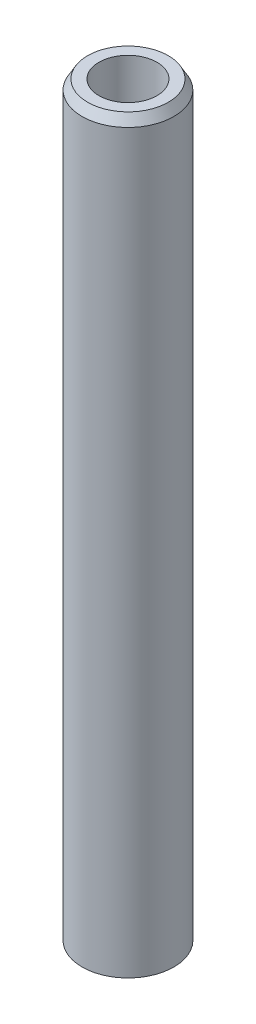
ISO-10303-21;
HEADER;
FILE_DESCRIPTION(('STEP AP214'),'2;1');
FILE_NAME('part.step','',(''),(''),'','','');
FILE_SCHEMA(('AUTOMOTIVE_DESIGN { 1 0 10303 214 1 1 1 1 }'));
ENDSEC;
DATA;
#1=APPLICATION_CONTEXT('core data for automotive mechanical design processes');
#2=APPLICATION_PROTOCOL_DEFINITION('international standard','automotive_design',2000,#1);
#3=PRODUCT_CONTEXT('',#1,'mechanical');
#4=PRODUCT('Part','Part','',(#3));
#5=PRODUCT_RELATED_PRODUCT_CATEGORY('part','',(#4));
#6=PRODUCT_DEFINITION_FORMATION('','',#4);
#7=PRODUCT_DEFINITION_CONTEXT('part definition',#1,'design');
#8=PRODUCT_DEFINITION('design','',#6,#7);
#9=PRODUCT_DEFINITION_SHAPE('','',#8);
#10=(LENGTH_UNIT() NAMED_UNIT(*) SI_UNIT(.MILLI.,.METRE.));
#11=(NAMED_UNIT(*) PLANE_ANGLE_UNIT() SI_UNIT($,.RADIAN.));
#12=(NAMED_UNIT(*) SI_UNIT($,.STERADIAN.) SOLID_ANGLE_UNIT());
#13=UNCERTAINTY_MEASURE_WITH_UNIT(LENGTH_MEASURE(1.E-05),#10,'distance_accuracy_value','');
#14=(GEOMETRIC_REPRESENTATION_CONTEXT(3) GLOBAL_UNCERTAINTY_ASSIGNED_CONTEXT((#13)) GLOBAL_UNIT_ASSIGNED_CONTEXT((#10,
#11,#12)) REPRESENTATION_CONTEXT('',''));
#15=CARTESIAN_POINT('',(0.,0.,0.));
#16=DIRECTION('',(0.,0.,1.));
#17=DIRECTION('',(1.,0.,0.));
#18=AXIS2_PLACEMENT_3D('',#15,#16,#17);
#19=CARTESIAN_POINT('',(0.,327.546325238168,0.));
#20=DIRECTION('',(0.,-1.,0.));
#21=DIRECTION('',(0.,0.,-1.));
#22=AXIS2_PLACEMENT_3D('',#19,#20,#21);
#23=CYLINDRICAL_SURFACE('',#22,20.);
#24=CARTESIAN_POINT('',(0.,323.367551301891,0.));
#25=DIRECTION('',(0.,1.,0.));
#26=DIRECTION('',(0.,0.,1.));
#27=AXIS2_PLACEMENT_3D('',#24,#25,#26);
#28=CIRCLE('',#27,20.);
#29=CARTESIAN_POINT('',(0.,323.367551301891,20.));
#30=VERTEX_POINT('',#29);
#31=EDGE_CURVE('E50',#30,#30,#28,.F.);
#32=ORIENTED_EDGE('',*,*,#31,.T.);
#33=EDGE_LOOP('',(#32));
#34=FACE_BOUND('',#33,.T.);
#35=CARTESIAN_POINT('',(0.,2.41261625699279,0.));
#36=DIRECTION('',(0.,1.,0.));
#37=DIRECTION('',(0.,0.,1.));
#38=AXIS2_PLACEMENT_3D('',#35,#36,#37);
#39=CIRCLE('',#38,20.);
#40=CARTESIAN_POINT('',(0.,2.41261625699279,20.));
#41=VERTEX_POINT('',#40);
#42=EDGE_CURVE('E51',#41,#41,#39,.T.);
#43=ORIENTED_EDGE('',*,*,#42,.T.);
#44=EDGE_LOOP('',(#43));
#45=FACE_BOUND('',#44,.T.);
#46=ADVANCED_FACE('F39',(#34,#45),#23,.T.);
#47=CARTESIAN_POINT('',(0.,327.546325238168,0.));
#48=DIRECTION('',(0.,1.,0.));
#49=DIRECTION('',(0.,0.,1.));
#50=AXIS2_PLACEMENT_3D('',#47,#48,#49);
#51=PLANE('',#50);
#52=CARTESIAN_POINT('',(0.,327.546325238168,0.));
#53=DIRECTION('',(0.,1.,0.));
#54=DIRECTION('',(0.,0.,1.));
#55=AXIS2_PLACEMENT_3D('',#52,#53,#54);
#56=CIRCLE('',#55,17.5873837430073);
#57=CARTESIAN_POINT('',(0.,327.546325238168,17.5873837430073));
#58=VERTEX_POINT('',#57);
#59=EDGE_CURVE('E54',#58,#58,#56,.T.);
#60=ORIENTED_EDGE('',*,*,#59,.T.);
#61=EDGE_LOOP('',(#60));
#62=FACE_BOUND('',#61,.T.);
#63=CARTESIAN_POINT('',(0.,327.546325238168,0.));
#64=DIRECTION('',(0.,1.,0.));
#65=DIRECTION('',(0.,0.,1.));
#66=AXIS2_PLACEMENT_3D('',#63,#64,#65);
#67=CIRCLE('',#66,12.639619362345);
#68=CARTESIAN_POINT('',(0.,327.546325238168,12.639619362345));
#69=VERTEX_POINT('',#68);
#70=EDGE_CURVE('E58',#69,#69,#67,.T.);
#71=ORIENTED_EDGE('',*,*,#70,.F.);
#72=EDGE_LOOP('',(#71));
#73=FACE_BOUND('',#72,.T.);
#74=ADVANCED_FACE('F69',(#62,#73),#51,.T.);
#75=CARTESIAN_POINT('',(0.,0.,0.));
#76=DIRECTION('',(0.,1.,0.));
#77=DIRECTION('',(0.,0.,1.));
#78=AXIS2_PLACEMENT_3D('',#75,#76,#77);
#79=PLANE('',#78);
#80=CARTESIAN_POINT('',(0.,0.,0.));
#81=DIRECTION('',(0.,1.,0.));
#82=DIRECTION('',(0.,0.,1.));
#83=AXIS2_PLACEMENT_3D('',#80,#81,#82);
#84=CIRCLE('',#83,15.8212260637218);
#85=CARTESIAN_POINT('',(0.,0.,15.8212260637218));
#86=VERTEX_POINT('',#85);
#87=EDGE_CURVE('E10',#86,#86,#84,.F.);
#88=ORIENTED_EDGE('',*,*,#87,.T.);
#89=EDGE_LOOP('',(#88));
#90=FACE_BOUND('',#89,.T.);
#91=CARTESIAN_POINT('',(0.,0.,0.));
#92=DIRECTION('',(0.,1.,0.));
#93=DIRECTION('',(0.,0.,1.));
#94=AXIS2_PLACEMENT_3D('',#91,#92,#93);
#95=CIRCLE('',#94,12.639619362345);
#96=CARTESIAN_POINT('',(0.,0.,12.639619362345));
#97=VERTEX_POINT('',#96);
#98=EDGE_CURVE('E63',#97,#97,#95,.T.);
#99=ORIENTED_EDGE('',*,*,#98,.T.);
#100=EDGE_LOOP('',(#99));
#101=FACE_BOUND('',#100,.T.);
#102=ADVANCED_FACE('F75',(#90,#101),#79,.F.);
#103=CARTESIAN_POINT('',(0.,327.546325238168,0.));
#104=DIRECTION('',(0.,-1.,0.));
#105=DIRECTION('',(0.,0.,-1.));
#106=AXIS2_PLACEMENT_3D('',#103,#104,#105);
#107=CYLINDRICAL_SURFACE('',#106,12.639619362345);
#108=ORIENTED_EDGE('',*,*,#70,.T.);
#109=EDGE_LOOP('',(#108));
#110=FACE_BOUND('',#109,.T.);
#111=ORIENTED_EDGE('',*,*,#98,.F.);
#112=EDGE_LOOP('',(#111));
#113=FACE_BOUND('',#112,.T.);
#114=ADVANCED_FACE('F70',(#110,#113),#107,.F.);
#115=CARTESIAN_POINT('',(0.,327.546325238168,0.));
#116=DIRECTION('',(0.,-1.,0.));
#117=DIRECTION('',(0.,0.,-1.));
#118=AXIS2_PLACEMENT_3D('',#115,#116,#117);
#119=CONICAL_SURFACE('',#118,17.5873837430073,0.523598775598291);
#120=ORIENTED_EDGE('',*,*,#31,.F.);
#121=EDGE_LOOP('',(#120));
#122=FACE_BOUND('',#121,.T.);
#123=ORIENTED_EDGE('',*,*,#59,.F.);
#124=EDGE_LOOP('',(#123));
#125=FACE_BOUND('',#124,.T.);
#126=ADVANCED_FACE('F81',(#122,#125),#119,.T.);
#127=CARTESIAN_POINT('',(0.,2.41261625699279,0.));
#128=DIRECTION('',(0.,1.,0.));
#129=DIRECTION('',(0.,0.,1.));
#130=AXIS2_PLACEMENT_3D('',#127,#128,#129);
#131=CONICAL_SURFACE('',#130,20.,1.0471975511966);
#132=ORIENTED_EDGE('',*,*,#87,.F.);
#133=EDGE_LOOP('',(#132));
#134=FACE_BOUND('',#133,.T.);
#135=ORIENTED_EDGE('',*,*,#42,.F.);
#136=EDGE_LOOP('',(#135));
#137=FACE_BOUND('',#136,.T.);
#138=ADVANCED_FACE('F45',(#134,#137),#131,.T.);
#139=CLOSED_SHELL('',(#46,#74,#102,#114,#126,#138));
#140=MANIFOLD_SOLID_BREP('B2',#139);
#141=ADVANCED_BREP_SHAPE_REPRESENTATION('',(#18,#140),#14);
#142=SHAPE_DEFINITION_REPRESENTATION(#9,#141);
ENDSEC;
END-ISO-10303-21;
